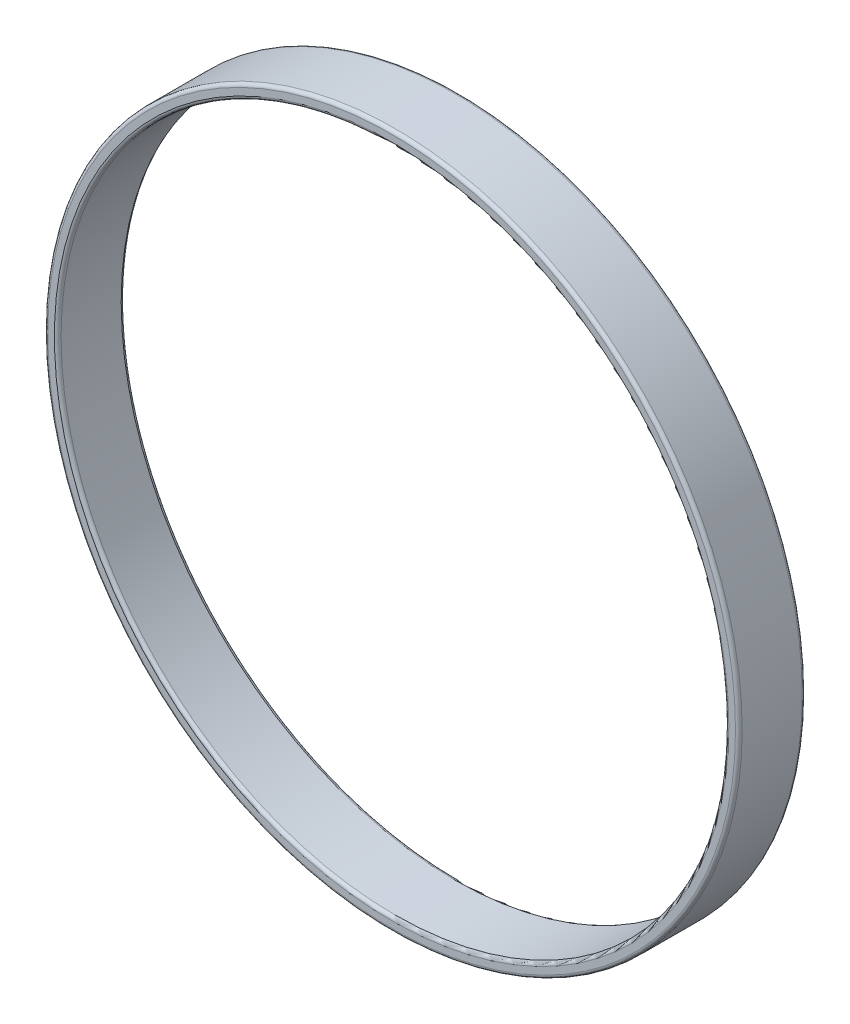
ISO-10303-21;
HEADER;
FILE_DESCRIPTION(('STEP AP214'),'2;1');
FILE_NAME('part.step','',(''),(''),'','','');
FILE_SCHEMA(('AUTOMOTIVE_DESIGN { 1 0 10303 214 1 1 1 1 }'));
ENDSEC;
DATA;
#1=APPLICATION_CONTEXT('core data for automotive mechanical design processes');
#2=APPLICATION_PROTOCOL_DEFINITION('international standard','automotive_design',2000,#1);
#3=PRODUCT_CONTEXT('',#1,'mechanical');
#4=PRODUCT('Part','Part','',(#3));
#5=PRODUCT_RELATED_PRODUCT_CATEGORY('part','',(#4));
#6=PRODUCT_DEFINITION_FORMATION('','',#4);
#7=PRODUCT_DEFINITION_CONTEXT('part definition',#1,'design');
#8=PRODUCT_DEFINITION('design','',#6,#7);
#9=PRODUCT_DEFINITION_SHAPE('','',#8);
#10=(LENGTH_UNIT() NAMED_UNIT(*) SI_UNIT(.MILLI.,.METRE.));
#11=(NAMED_UNIT(*) PLANE_ANGLE_UNIT() SI_UNIT($,.RADIAN.));
#12=(NAMED_UNIT(*) SI_UNIT($,.STERADIAN.) SOLID_ANGLE_UNIT());
#13=UNCERTAINTY_MEASURE_WITH_UNIT(LENGTH_MEASURE(1.E-05),#10,'distance_accuracy_value','');
#14=(GEOMETRIC_REPRESENTATION_CONTEXT(3) GLOBAL_UNCERTAINTY_ASSIGNED_CONTEXT((#13)) GLOBAL_UNIT_ASSIGNED_CONTEXT((#10,
#11,#12)) REPRESENTATION_CONTEXT('',''));
#15=CARTESIAN_POINT('',(0.,0.,0.));
#16=DIRECTION('',(0.,0.,1.));
#17=DIRECTION('',(1.,0.,0.));
#18=AXIS2_PLACEMENT_3D('',#15,#16,#17);
#19=CARTESIAN_POINT('',(0.,0.,10.));
#20=DIRECTION('',(0.,0.,1.));
#21=DIRECTION('',(1.,0.,0.));
#22=AXIS2_PLACEMENT_3D('',#19,#20,#21);
#23=PLANE('',#22);
#24=CARTESIAN_POINT('',(0.,0.,10.));
#25=DIRECTION('',(0.,0.,1.));
#26=DIRECTION('',(1.,0.,0.));
#27=AXIS2_PLACEMENT_3D('',#24,#25,#26);
#28=CIRCLE('',#27,50.5);
#29=CARTESIAN_POINT('',(50.5,0.,10.));
#30=VERTEX_POINT('',#29);
#31=EDGE_CURVE('E51',#30,#30,#28,.F.);
#32=ORIENTED_EDGE('',*,*,#31,.T.);
#33=EDGE_LOOP('',(#32));
#34=FACE_BOUND('',#33,.T.);
#35=CARTESIAN_POINT('',(0.,0.,10.));
#36=DIRECTION('',(0.,0.,1.));
#37=DIRECTION('',(1.,0.,0.));
#38=AXIS2_PLACEMENT_3D('',#35,#36,#37);
#39=CIRCLE('',#38,51.5);
#40=CARTESIAN_POINT('',(51.5,0.,10.));
#41=VERTEX_POINT('',#40);
#42=EDGE_CURVE('E54',#41,#41,#39,.T.);
#43=ORIENTED_EDGE('',*,*,#42,.T.);
#44=EDGE_LOOP('',(#43));
#45=FACE_BOUND('',#44,.T.);
#46=ADVANCED_FACE('F31',(#34,#45),#23,.T.);
#47=CARTESIAN_POINT('',(0.,0.,0.));
#48=DIRECTION('',(0.,0.,1.));
#49=DIRECTION('',(1.,0.,0.));
#50=AXIS2_PLACEMENT_3D('',#47,#48,#49);
#51=PLANE('',#50);
#52=CARTESIAN_POINT('',(0.,0.,0.));
#53=DIRECTION('',(0.,0.,1.));
#54=DIRECTION('',(1.,0.,0.));
#55=AXIS2_PLACEMENT_3D('',#52,#53,#54);
#56=CIRCLE('',#55,50.5);
#57=CARTESIAN_POINT('',(50.5,0.,0.));
#58=VERTEX_POINT('',#57);
#59=EDGE_CURVE('E10',#58,#58,#56,.T.);
#60=ORIENTED_EDGE('',*,*,#59,.T.);
#61=EDGE_LOOP('',(#60));
#62=FACE_BOUND('',#61,.T.);
#63=CARTESIAN_POINT('',(0.,0.,0.));
#64=DIRECTION('',(0.,0.,1.));
#65=DIRECTION('',(1.,0.,0.));
#66=AXIS2_PLACEMENT_3D('',#63,#64,#65);
#67=CIRCLE('',#66,51.5);
#68=CARTESIAN_POINT('',(51.5,0.,0.));
#69=VERTEX_POINT('',#68);
#70=EDGE_CURVE('E38',#69,#69,#67,.F.);
#71=ORIENTED_EDGE('',*,*,#70,.T.);
#72=EDGE_LOOP('',(#71));
#73=FACE_BOUND('',#72,.T.);
#74=ADVANCED_FACE('F79',(#62,#73),#51,.F.);
#75=CARTESIAN_POINT('',(0.,0.,10.));
#76=DIRECTION('',(0.,0.,-1.));
#77=DIRECTION('',(-1.,0.,0.));
#78=AXIS2_PLACEMENT_3D('',#75,#76,#77);
#79=CYLINDRICAL_SURFACE('',#78,52.);
#80=CARTESIAN_POINT('',(0.,0.,9.5));
#81=DIRECTION('',(0.,0.,1.));
#82=DIRECTION('',(1.,0.,0.));
#83=AXIS2_PLACEMENT_3D('',#80,#81,#82);
#84=CIRCLE('',#83,52.);
#85=CARTESIAN_POINT('',(52.,0.,9.5));
#86=VERTEX_POINT('',#85);
#87=EDGE_CURVE('E42',#86,#86,#84,.F.);
#88=ORIENTED_EDGE('',*,*,#87,.T.);
#89=EDGE_LOOP('',(#88));
#90=FACE_BOUND('',#89,.T.);
#91=CARTESIAN_POINT('',(0.,0.,0.5));
#92=DIRECTION('',(0.,0.,1.));
#93=DIRECTION('',(1.,0.,0.));
#94=AXIS2_PLACEMENT_3D('',#91,#92,#93);
#95=CIRCLE('',#94,52.);
#96=CARTESIAN_POINT('',(52.,0.,0.5));
#97=VERTEX_POINT('',#96);
#98=EDGE_CURVE('E46',#97,#97,#95,.T.);
#99=ORIENTED_EDGE('',*,*,#98,.T.);
#100=EDGE_LOOP('',(#99));
#101=FACE_BOUND('',#100,.T.);
#102=ADVANCED_FACE('F85',(#90,#101),#79,.T.);
#103=CARTESIAN_POINT('',(0.,0.,10.));
#104=DIRECTION('',(0.,0.,-1.));
#105=DIRECTION('',(-1.,0.,0.));
#106=AXIS2_PLACEMENT_3D('',#103,#104,#105);
#107=CYLINDRICAL_SURFACE('',#106,50.);
#108=CARTESIAN_POINT('',(0.,0.,9.5));
#109=DIRECTION('',(0.,0.,1.));
#110=DIRECTION('',(1.,0.,0.));
#111=AXIS2_PLACEMENT_3D('',#108,#109,#110);
#112=CIRCLE('',#111,50.);
#113=CARTESIAN_POINT('',(50.,0.,9.5));
#114=VERTEX_POINT('',#113);
#115=EDGE_CURVE('E57',#114,#114,#112,.T.);
#116=ORIENTED_EDGE('',*,*,#115,.T.);
#117=EDGE_LOOP('',(#116));
#118=FACE_BOUND('',#117,.T.);
#119=CARTESIAN_POINT('',(0.,0.,0.5));
#120=DIRECTION('',(0.,0.,1.));
#121=DIRECTION('',(1.,0.,0.));
#122=AXIS2_PLACEMENT_3D('',#119,#120,#121);
#123=CIRCLE('',#122,50.);
#124=CARTESIAN_POINT('',(50.,0.,0.5));
#125=VERTEX_POINT('',#124);
#126=EDGE_CURVE('E60',#125,#125,#123,.F.);
#127=ORIENTED_EDGE('',*,*,#126,.T.);
#128=EDGE_LOOP('',(#127));
#129=FACE_BOUND('',#128,.T.);
#130=ADVANCED_FACE('F64',(#118,#129),#107,.F.);
#131=CARTESIAN_POINT('',(0.,0.,9.5));
#132=DIRECTION('',(0.,0.,1.));
#133=DIRECTION('',(1.,0.,0.));
#134=AXIS2_PLACEMENT_3D('',#131,#132,#133);
#135=TOROIDAL_SURFACE('',#134,50.5,0.5);
#136=ORIENTED_EDGE('',*,*,#31,.F.);
#137=EDGE_LOOP('',(#136));
#138=FACE_BOUND('',#137,.T.);
#139=ORIENTED_EDGE('',*,*,#115,.F.);
#140=EDGE_LOOP('',(#139));
#141=FACE_BOUND('',#140,.T.);
#142=ADVANCED_FACE('F75',(#138,#141),#135,.T.);
#143=CARTESIAN_POINT('',(0.,0.,9.5));
#144=DIRECTION('',(0.,0.,1.));
#145=DIRECTION('',(1.,0.,0.));
#146=AXIS2_PLACEMENT_3D('',#143,#144,#145);
#147=TOROIDAL_SURFACE('',#146,51.5,0.5);
#148=ORIENTED_EDGE('',*,*,#87,.F.);
#149=EDGE_LOOP('',(#148));
#150=FACE_BOUND('',#149,.T.);
#151=ORIENTED_EDGE('',*,*,#42,.F.);
#152=EDGE_LOOP('',(#151));
#153=FACE_BOUND('',#152,.T.);
#154=ADVANCED_FACE('F69',(#150,#153),#147,.T.);
#155=CARTESIAN_POINT('',(0.,0.,0.5));
#156=DIRECTION('',(0.,0.,1.));
#157=DIRECTION('',(1.,0.,0.));
#158=AXIS2_PLACEMENT_3D('',#155,#156,#157);
#159=TOROIDAL_SURFACE('',#158,50.5,0.5);
#160=ORIENTED_EDGE('',*,*,#126,.F.);
#161=EDGE_LOOP('',(#160));
#162=FACE_BOUND('',#161,.T.);
#163=ORIENTED_EDGE('',*,*,#59,.F.);
#164=EDGE_LOOP('',(#163));
#165=FACE_BOUND('',#164,.T.);
#166=ADVANCED_FACE('F66',(#162,#165),#159,.T.);
#167=CARTESIAN_POINT('',(0.,0.,0.5));
#168=DIRECTION('',(0.,0.,1.));
#169=DIRECTION('',(1.,0.,0.));
#170=AXIS2_PLACEMENT_3D('',#167,#168,#169);
#171=TOROIDAL_SURFACE('',#170,51.5,0.5);
#172=ORIENTED_EDGE('',*,*,#70,.F.);
#173=EDGE_LOOP('',(#172));
#174=FACE_BOUND('',#173,.T.);
#175=ORIENTED_EDGE('',*,*,#98,.F.);
#176=EDGE_LOOP('',(#175));
#177=FACE_BOUND('',#176,.T.);
#178=ADVANCED_FACE('F33',(#174,#177),#171,.T.);
#179=CLOSED_SHELL('',(#46,#74,#102,#130,#142,#154,#166,#178));
#180=MANIFOLD_SOLID_BREP('B2',#179);
#181=ADVANCED_BREP_SHAPE_REPRESENTATION('',(#18,#180),#14);
#182=SHAPE_DEFINITION_REPRESENTATION(#9,#181);
ENDSEC;
END-ISO-10303-21;
